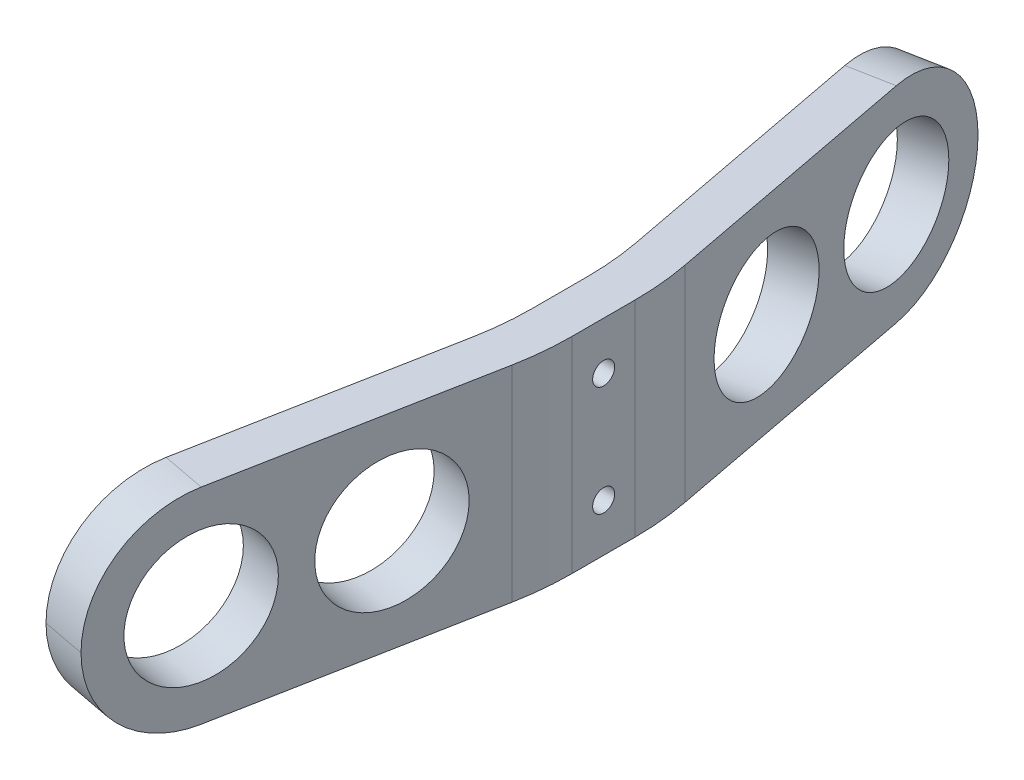
ISO-10303-21;
HEADER;
FILE_DESCRIPTION(('STEP AP214'),'2;1');
FILE_NAME('part.step','',(''),(''),'','','');
FILE_SCHEMA(('AUTOMOTIVE_DESIGN { 1 0 10303 214 1 1 1 1 }'));
ENDSEC;
DATA;
#1=APPLICATION_CONTEXT('core data for automotive mechanical design processes');
#2=APPLICATION_PROTOCOL_DEFINITION('international standard','automotive_design',2000,#1);
#3=PRODUCT_CONTEXT('',#1,'mechanical');
#4=PRODUCT('Part','Part','',(#3));
#5=PRODUCT_RELATED_PRODUCT_CATEGORY('part','',(#4));
#6=PRODUCT_DEFINITION_FORMATION('','',#4);
#7=PRODUCT_DEFINITION_CONTEXT('part definition',#1,'design');
#8=PRODUCT_DEFINITION('design','',#6,#7);
#9=PRODUCT_DEFINITION_SHAPE('','',#8);
#10=(LENGTH_UNIT() NAMED_UNIT(*) SI_UNIT(.MILLI.,.METRE.));
#11=(NAMED_UNIT(*) PLANE_ANGLE_UNIT() SI_UNIT($,.RADIAN.));
#12=(NAMED_UNIT(*) SI_UNIT($,.STERADIAN.) SOLID_ANGLE_UNIT());
#13=UNCERTAINTY_MEASURE_WITH_UNIT(LENGTH_MEASURE(1.E-05),#10,'distance_accuracy_value','');
#14=(GEOMETRIC_REPRESENTATION_CONTEXT(3) GLOBAL_UNCERTAINTY_ASSIGNED_CONTEXT((#13)) GLOBAL_UNIT_ASSIGNED_CONTEXT((#10,
#11,#12)) REPRESENTATION_CONTEXT('',''));
#15=CARTESIAN_POINT('',(0.,0.,0.));
#16=DIRECTION('',(0.,0.,1.));
#17=DIRECTION('',(1.,0.,0.));
#18=AXIS2_PLACEMENT_3D('',#15,#16,#17);
#19=CARTESIAN_POINT('',(16.,28.,8.06633748964791));
#20=DIRECTION('',(-0.982338566422475,0.,-0.187112107889995));
#21=DIRECTION('',(-0.187112107889995,0.,0.982338566422475));
#22=AXIS2_PLACEMENT_3D('',#19,#20,#21);
#23=PLANE('',#22);
#24=CARTESIAN_POINT('',(8.51360090899477,14.,47.3699327174253));
#25=DIRECTION('',(0.982338566422475,0.,0.187112107889995));
#26=DIRECTION('',(0.187112107889995,0.,-0.982338566422475));
#27=AXIS2_PLACEMENT_3D('',#24,#25,#26);
#28=CIRCLE('',#27,9.);
#29=CARTESIAN_POINT('',(10.1976098800047,14.,38.5288856196231));
#30=VERTEX_POINT('',#29);
#31=EDGE_CURVE('E462',#30,#30,#28,.T.);
#32=ORIENTED_EDGE('',*,*,#31,.F.);
#33=EDGE_LOOP('',(#32));
#34=FACE_BOUND('',#33,.T.);
#35=CARTESIAN_POINT('',(12.6739731464391,14.,25.5279784708429));
#36=DIRECTION('',(0.982338566422475,0.,0.187112107889995));
#37=DIRECTION('',(0.187112107889995,0.,-0.982338566422475));
#38=AXIS2_PLACEMENT_3D('',#35,#36,#37);
#39=CIRCLE('',#38,9.);
#40=CARTESIAN_POINT('',(14.357982117449,14.,16.6869313730406));
#41=VERTEX_POINT('',#40);
#42=EDGE_CURVE('E463',#41,#41,#39,.T.);
#43=ORIENTED_EDGE('',*,*,#42,.F.);
#44=EDGE_LOOP('',(#43));
#45=FACE_BOUND('',#44,.T.);
#46=CARTESIAN_POINT('',(8.51360090899477,14.,47.3699327174253));
#47=DIRECTION('',(-0.982338566422475,0.,-0.187112107889995));
#48=DIRECTION('',(-0.187112107889995,0.,0.982338566422475));
#49=AXIS2_PLACEMENT_3D('',#46,#47,#48);
#50=CIRCLE('',#49,14.);
#51=CARTESIAN_POINT('',(8.51360090899477,28.,47.3699327174253));
#52=VERTEX_POINT('',#51);
#53=CARTESIAN_POINT('',(5.89403139853484,14.,61.12267264734));
#54=VERTEX_POINT('',#53);
#55=EDGE_CURVE('E55',#52,#54,#50,.F.);
#56=ORIENTED_EDGE('',*,*,#55,.T.);
#57=CARTESIAN_POINT('',(8.51360090899477,14.,47.3699327174253));
#58=DIRECTION('',(-0.982338566422475,0.,-0.187112107889995));
#59=DIRECTION('',(-0.187112107889995,0.,0.982338566422475));
#60=AXIS2_PLACEMENT_3D('',#57,#58,#59);
#61=CIRCLE('',#60,14.);
#62=CARTESIAN_POINT('',(8.51360090899477,0.,47.3699327174253));
#63=VERTEX_POINT('',#62);
#64=EDGE_CURVE('E217',#54,#63,#61,.F.);
#65=ORIENTED_EDGE('',*,*,#64,.T.);
#66=DIRECTION('',(0.187112107889995,0.,-0.982338566422475));
#67=VECTOR('',#66,1.);
#68=CARTESIAN_POINT('',(16.,0.,8.06633748964791));
#69=LINE('',#68,#67);
#70=CARTESIAN_POINT('',(15.293542656899,0.,11.7752385409282));
#71=VERTEX_POINT('',#70);
#72=EDGE_CURVE('E244',#63,#71,#69,.T.);
#73=ORIENTED_EDGE('',*,*,#72,.T.);
#74=DIRECTION('',(0.,-1.,0.));
#75=VECTOR('',#74,1.);
#76=CARTESIAN_POINT('',(15.293542656899,28.,11.7752385409282));
#77=LINE('',#76,#75);
#78=CARTESIAN_POINT('',(15.293542656899,28.,11.7752385409282));
#79=VERTEX_POINT('',#78);
#80=EDGE_CURVE('E145',#71,#79,#77,.F.);
#81=ORIENTED_EDGE('',*,*,#80,.T.);
#82=DIRECTION('',(0.187112107889995,0.,-0.982338566422475));
#83=VECTOR('',#82,1.);
#84=CARTESIAN_POINT('',(16.,28.,8.06633748964791));
#85=LINE('',#84,#83);
#86=EDGE_CURVE('E160',#52,#79,#85,.T.);
#87=ORIENTED_EDGE('',*,*,#86,.F.);
#88=EDGE_LOOP('',(#56,#65,#73,#81,#87));
#89=FACE_BOUND('',#88,.T.);
#90=ADVANCED_FACE('F32',(#34,#45,#89),#23,.F.);
#91=CARTESIAN_POINT('',(16.,28.,-8.06633748964794));
#92=DIRECTION('',(-1.,0.,0.));
#93=DIRECTION('',(0.,0.,1.));
#94=AXIS2_PLACEMENT_3D('',#91,#92,#93);
#95=PLANE('',#94);
#96=CARTESIAN_POINT('',(16.,21.5,0.));
#97=DIRECTION('',(1.,0.,0.));
#98=DIRECTION('',(0.,0.,-1.));
#99=AXIS2_PLACEMENT_3D('',#96,#97,#98);
#100=CIRCLE('',#99,1.5);
#101=CARTESIAN_POINT('',(16.,21.5,-1.50000000000001));
#102=VERTEX_POINT('',#101);
#103=EDGE_CURVE('E480',#102,#102,#100,.T.);
#104=ORIENTED_EDGE('',*,*,#103,.F.);
#105=EDGE_LOOP('',(#104));
#106=FACE_BOUND('',#105,.T.);
#107=CARTESIAN_POINT('',(16.,6.5,0.));
#108=DIRECTION('',(1.,0.,0.));
#109=DIRECTION('',(0.,0.,-1.));
#110=AXIS2_PLACEMENT_3D('',#107,#108,#109);
#111=CIRCLE('',#110,1.5);
#112=CARTESIAN_POINT('',(16.,6.5,-1.5));
#113=VERTEX_POINT('',#112);
#114=EDGE_CURVE('E221',#113,#113,#111,.T.);
#115=ORIENTED_EDGE('',*,*,#114,.F.);
#116=EDGE_LOOP('',(#115));
#117=FACE_BOUND('',#116,.T.);
#118=DIRECTION('',(0.,0.,-1.));
#119=VECTOR('',#118,1.);
#120=CARTESIAN_POINT('',(16.,0.,-8.06633748964794));
#121=LINE('',#120,#119);
#122=CARTESIAN_POINT('',(16.,0.,4.2907542253284));
#123=VERTEX_POINT('',#122);
#124=CARTESIAN_POINT('',(16.,0.,-4.29075422532843));
#125=VERTEX_POINT('',#124);
#126=EDGE_CURVE('E246',#123,#125,#121,.T.);
#127=ORIENTED_EDGE('',*,*,#126,.T.);
#128=DIRECTION('',(0.,-1.,0.));
#129=VECTOR('',#128,1.);
#130=CARTESIAN_POINT('',(16.,28.,-4.29075422532843));
#131=LINE('',#130,#129);
#132=CARTESIAN_POINT('',(16.,28.,-4.29075422532843));
#133=VERTEX_POINT('',#132);
#134=EDGE_CURVE('E186',#125,#133,#131,.F.);
#135=ORIENTED_EDGE('',*,*,#134,.T.);
#136=DIRECTION('',(0.,0.,-1.));
#137=VECTOR('',#136,1.);
#138=CARTESIAN_POINT('',(16.,28.,-8.06633748964794));
#139=LINE('',#138,#137);
#140=CARTESIAN_POINT('',(16.,28.,4.2907542253284));
#141=VERTEX_POINT('',#140);
#142=EDGE_CURVE('E163',#141,#133,#139,.T.);
#143=ORIENTED_EDGE('',*,*,#142,.F.);
#144=DIRECTION('',(0.,-1.,0.));
#145=VECTOR('',#144,1.);
#146=CARTESIAN_POINT('',(16.,28.,4.2907542253284));
#147=LINE('',#146,#145);
#148=EDGE_CURVE('E183',#141,#123,#147,.T.);
#149=ORIENTED_EDGE('',*,*,#148,.T.);
#150=EDGE_LOOP('',(#127,#135,#143,#149));
#151=FACE_BOUND('',#150,.T.);
#152=ADVANCED_FACE('F279',(#106,#117,#151),#95,.F.);
#153=CARTESIAN_POINT('',(5.89403139853485,28.,-61.12267264734));
#154=DIRECTION('',(-0.982338566422475,0.,0.187112107889995));
#155=DIRECTION('',(0.187112107889995,0.,0.982338566422475));
#156=AXIS2_PLACEMENT_3D('',#153,#154,#155);
#157=PLANE('',#156);
#158=CARTESIAN_POINT('',(8.51360090899477,14.,-47.3699327174253));
#159=DIRECTION('',(-0.982338566422475,0.,0.187112107889995));
#160=DIRECTION('',(0.187112107889995,0.,0.982338566422475));
#161=AXIS2_PLACEMENT_3D('',#158,#159,#160);
#162=CIRCLE('',#161,9.);
#163=CARTESIAN_POINT('',(10.1976098800047,14.,-38.5288856196231));
#164=VERTEX_POINT('',#163);
#165=EDGE_CURVE('E438',#164,#164,#162,.T.);
#166=ORIENTED_EDGE('',*,*,#165,.T.);
#167=EDGE_LOOP('',(#166));
#168=FACE_BOUND('',#167,.T.);
#169=CARTESIAN_POINT('',(12.6739731464391,14.,-25.5279784708429));
#170=DIRECTION('',(-0.982338566422475,0.,0.187112107889995));
#171=DIRECTION('',(0.187112107889995,0.,0.982338566422475));
#172=AXIS2_PLACEMENT_3D('',#169,#170,#171);
#173=CIRCLE('',#172,9.);
#174=CARTESIAN_POINT('',(14.357982117449,14.,-16.6869313730406));
#175=VERTEX_POINT('',#174);
#176=EDGE_CURVE('E442',#175,#175,#173,.T.);
#177=ORIENTED_EDGE('',*,*,#176,.T.);
#178=EDGE_LOOP('',(#177));
#179=FACE_BOUND('',#178,.T.);
#180=DIRECTION('',(-0.187112107889995,0.,-0.982338566422475));
#181=VECTOR('',#180,1.);
#182=CARTESIAN_POINT('',(5.89403139853485,0.,-61.12267264734));
#183=LINE('',#182,#181);
#184=CARTESIAN_POINT('',(15.293542656899,0.,-11.7752385409282));
#185=VERTEX_POINT('',#184);
#186=CARTESIAN_POINT('',(8.51360090899478,0.,-47.3699327174253));
#187=VERTEX_POINT('',#186);
#188=EDGE_CURVE('E250',#185,#187,#183,.T.);
#189=ORIENTED_EDGE('',*,*,#188,.T.);
#190=CARTESIAN_POINT('',(8.51360090899478,14.,-47.3699327174253));
#191=DIRECTION('',(-0.982338566422475,0.,0.187112107889995));
#192=DIRECTION('',(0.187112107889995,0.,0.982338566422475));
#193=AXIS2_PLACEMENT_3D('',#190,#191,#192);
#194=CIRCLE('',#193,14.);
#195=CARTESIAN_POINT('',(5.89403139853485,14.,-61.12267264734));
#196=VERTEX_POINT('',#195);
#197=EDGE_CURVE('E210',#187,#196,#194,.F.);
#198=ORIENTED_EDGE('',*,*,#197,.T.);
#199=CARTESIAN_POINT('',(8.51360090899478,14.,-47.3699327174253));
#200=DIRECTION('',(-0.982338566422475,0.,0.187112107889995));
#201=DIRECTION('',(0.187112107889995,0.,0.982338566422475));
#202=AXIS2_PLACEMENT_3D('',#199,#200,#201);
#203=CIRCLE('',#202,14.);
#204=CARTESIAN_POINT('',(8.51360090899478,28.,-47.3699327174253));
#205=VERTEX_POINT('',#204);
#206=EDGE_CURVE('E208',#196,#205,#203,.F.);
#207=ORIENTED_EDGE('',*,*,#206,.T.);
#208=DIRECTION('',(-0.187112107889995,0.,-0.982338566422475));
#209=VECTOR('',#208,1.);
#210=CARTESIAN_POINT('',(5.89403139853485,28.,-61.12267264734));
#211=LINE('',#210,#209);
#212=CARTESIAN_POINT('',(15.293542656899,28.,-11.7752385409282));
#213=VERTEX_POINT('',#212);
#214=EDGE_CURVE('E454',#213,#205,#211,.T.);
#215=ORIENTED_EDGE('',*,*,#214,.F.);
#216=DIRECTION('',(0.,-1.,0.));
#217=VECTOR('',#216,1.);
#218=CARTESIAN_POINT('',(15.293542656899,28.,-11.7752385409282));
#219=LINE('',#218,#217);
#220=EDGE_CURVE('E175',#213,#185,#219,.T.);
#221=ORIENTED_EDGE('',*,*,#220,.T.);
#222=EDGE_LOOP('',(#189,#198,#207,#215,#221));
#223=FACE_BOUND('',#222,.T.);
#224=ADVANCED_FACE('F273',(#168,#179,#223),#157,.F.);
#225=CARTESIAN_POINT('',(0.,28.,-60.));
#226=DIRECTION('',(0.982338566422475,0.,-0.187112107889995));
#227=DIRECTION('',(-0.187112107889995,0.,-0.982338566422475));
#228=AXIS2_PLACEMENT_3D('',#225,#226,#227);
#229=PLANE('',#228);
#230=CARTESIAN_POINT('',(2.61956951045993,14.,-46.2472600700854));
#231=DIRECTION('',(0.982338566422475,0.,-0.187112107889995));
#232=DIRECTION('',(-0.187112107889995,0.,-0.982338566422475));
#233=AXIS2_PLACEMENT_3D('',#230,#231,#232);
#234=CIRCLE('',#233,9.);
#235=CARTESIAN_POINT('',(0.935560539449972,14.,-55.0883071678876));
#236=VERTEX_POINT('',#235);
#237=EDGE_CURVE('E475',#236,#236,#234,.T.);
#238=ORIENTED_EDGE('',*,*,#237,.T.);
#239=EDGE_LOOP('',(#238));
#240=FACE_BOUND('',#239,.T.);
#241=CARTESIAN_POINT('',(6.77994174790421,14.,-24.4053058235029));
#242=DIRECTION('',(0.982338566422475,0.,-0.187112107889995));
#243=DIRECTION('',(-0.187112107889995,0.,-0.982338566422475));
#244=AXIS2_PLACEMENT_3D('',#241,#242,#243);
#245=CIRCLE('',#244,9.);
#246=CARTESIAN_POINT('',(5.09593277689425,14.,-33.2463529213052));
#247=VERTEX_POINT('',#246);
#248=EDGE_CURVE('E470',#247,#247,#245,.T.);
#249=ORIENTED_EDGE('',*,*,#248,.T.);
#250=EDGE_LOOP('',(#249));
#251=FACE_BOUND('',#250,.T.);
#252=CARTESIAN_POINT('',(2.61956951045993,14.,-46.2472600700854));
#253=DIRECTION('',(0.982338566422475,0.,-0.187112107889995));
#254=DIRECTION('',(-0.187112107889995,0.,-0.982338566422475));
#255=AXIS2_PLACEMENT_3D('',#252,#253,#254);
#256=CIRCLE('',#255,14.);
#257=CARTESIAN_POINT('',(2.61956951045993,28.,-46.2472600700854));
#258=VERTEX_POINT('',#257);
#259=CARTESIAN_POINT('',(0.,14.,-60.));
#260=VERTEX_POINT('',#259);
#261=EDGE_CURVE('E200',#258,#260,#256,.F.);
#262=ORIENTED_EDGE('',*,*,#261,.T.);
#263=CARTESIAN_POINT('',(2.61956951045993,14.,-46.2472600700854));
#264=DIRECTION('',(0.982338566422475,0.,-0.187112107889995));
#265=DIRECTION('',(-0.187112107889995,0.,-0.982338566422475));
#266=AXIS2_PLACEMENT_3D('',#263,#264,#265);
#267=CIRCLE('',#266,14.);
#268=CARTESIAN_POINT('',(2.61956951045993,0.,-46.2472600700854));
#269=VERTEX_POINT('',#268);
#270=EDGE_CURVE('E202',#260,#269,#267,.F.);
#271=ORIENTED_EDGE('',*,*,#270,.T.);
#272=DIRECTION('',(0.187112107889995,0.,0.982338566422475));
#273=VECTOR('',#272,1.);
#274=CARTESIAN_POINT('',(0.,0.,-60.));
#275=LINE('',#274,#273);
#276=CARTESIAN_POINT('',(9.293542656899,0.,-11.2089010512803));
#277=VERTEX_POINT('',#276);
#278=EDGE_CURVE('E165',#269,#277,#275,.T.);
#279=ORIENTED_EDGE('',*,*,#278,.T.);
#280=DIRECTION('',(0.,-1.,0.));
#281=VECTOR('',#280,1.);
#282=CARTESIAN_POINT('',(9.293542656899,28.,-11.2089010512803));
#283=LINE('',#282,#281);
#284=CARTESIAN_POINT('',(9.293542656899,28.,-11.2089010512803));
#285=VERTEX_POINT('',#284);
#286=EDGE_CURVE('E172',#277,#285,#283,.F.);
#287=ORIENTED_EDGE('',*,*,#286,.T.);
#288=DIRECTION('',(0.187112107889995,0.,0.982338566422475));
#289=VECTOR('',#288,1.);
#290=CARTESIAN_POINT('',(0.,28.,-60.));
#291=LINE('',#290,#289);
#292=EDGE_CURVE('E240',#258,#285,#291,.T.);
#293=ORIENTED_EDGE('',*,*,#292,.F.);
#294=EDGE_LOOP('',(#262,#271,#279,#287,#293));
#295=FACE_BOUND('',#294,.T.);
#296=ADVANCED_FACE('F253',(#240,#251,#295),#229,.F.);
#297=CARTESIAN_POINT('',(10.,28.,-7.5));
#298=DIRECTION('',(1.,0.,0.));
#299=DIRECTION('',(0.,0.,-1.));
#300=AXIS2_PLACEMENT_3D('',#297,#298,#299);
#301=PLANE('',#300);
#302=CARTESIAN_POINT('',(10.,21.5,0.));
#303=DIRECTION('',(1.,0.,0.));
#304=DIRECTION('',(0.,0.,-1.));
#305=AXIS2_PLACEMENT_3D('',#302,#303,#304);
#306=CIRCLE('',#305,1.5);
#307=CARTESIAN_POINT('',(10.,21.5,-1.5));
#308=VERTEX_POINT('',#307);
#309=EDGE_CURVE('E473',#308,#308,#306,.F.);
#310=ORIENTED_EDGE('',*,*,#309,.F.);
#311=EDGE_LOOP('',(#310));
#312=FACE_BOUND('',#311,.T.);
#313=CARTESIAN_POINT('',(10.,6.5,0.));
#314=DIRECTION('',(1.,0.,0.));
#315=DIRECTION('',(0.,0.,-1.));
#316=AXIS2_PLACEMENT_3D('',#313,#314,#315);
#317=CIRCLE('',#316,1.5);
#318=CARTESIAN_POINT('',(10.,6.5,-1.5));
#319=VERTEX_POINT('',#318);
#320=EDGE_CURVE('E226',#319,#319,#317,.F.);
#321=ORIENTED_EDGE('',*,*,#320,.F.);
#322=EDGE_LOOP('',(#321));
#323=FACE_BOUND('',#322,.T.);
#324=DIRECTION('',(0.,0.,1.));
#325=VECTOR('',#324,1.);
#326=CARTESIAN_POINT('',(10.,0.,-7.5));
#327=LINE('',#326,#325);
#328=CARTESIAN_POINT('',(10.,0.,-3.72441673568047));
#329=VERTEX_POINT('',#328);
#330=CARTESIAN_POINT('',(10.,0.,3.72441673568047));
#331=VERTEX_POINT('',#330);
#332=EDGE_CURVE('E161',#329,#331,#327,.T.);
#333=ORIENTED_EDGE('',*,*,#332,.T.);
#334=DIRECTION('',(0.,-1.,0.));
#335=VECTOR('',#334,1.);
#336=CARTESIAN_POINT('',(10.,28.,3.72441673568047));
#337=LINE('',#336,#335);
#338=CARTESIAN_POINT('',(10.,28.,3.72441673568047));
#339=VERTEX_POINT('',#338);
#340=EDGE_CURVE('E139',#331,#339,#337,.F.);
#341=ORIENTED_EDGE('',*,*,#340,.T.);
#342=DIRECTION('',(0.,0.,1.));
#343=VECTOR('',#342,1.);
#344=CARTESIAN_POINT('',(10.,28.,-7.5));
#345=LINE('',#344,#343);
#346=CARTESIAN_POINT('',(10.,28.,-3.72441673568047));
#347=VERTEX_POINT('',#346);
#348=EDGE_CURVE('E238',#347,#339,#345,.T.);
#349=ORIENTED_EDGE('',*,*,#348,.F.);
#350=DIRECTION('',(0.,-1.,0.));
#351=VECTOR('',#350,1.);
#352=CARTESIAN_POINT('',(10.,0.,-3.72441673568047));
#353=LINE('',#352,#351);
#354=EDGE_CURVE('E152',#347,#329,#353,.T.);
#355=ORIENTED_EDGE('',*,*,#354,.T.);
#356=EDGE_LOOP('',(#333,#341,#349,#355));
#357=FACE_BOUND('',#356,.T.);
#358=ADVANCED_FACE('F263',(#312,#323,#357),#301,.F.);
#359=CARTESIAN_POINT('',(10.,28.,7.5));
#360=DIRECTION('',(0.982338566422475,0.,0.187112107889995));
#361=DIRECTION('',(0.187112107889995,0.,-0.982338566422475));
#362=AXIS2_PLACEMENT_3D('',#359,#360,#361);
#363=PLANE('',#362);
#364=CARTESIAN_POINT('',(2.61956951045993,14.,46.2472600700854));
#365=DIRECTION('',(0.982338566422475,0.,0.187112107889995));
#366=DIRECTION('',(0.187112107889995,0.,-0.982338566422475));
#367=AXIS2_PLACEMENT_3D('',#364,#365,#366);
#368=CIRCLE('',#367,9.);
#369=CARTESIAN_POINT('',(4.30357848146989,14.,37.4062129722831));
#370=VERTEX_POINT('',#369);
#371=EDGE_CURVE('E247',#370,#370,#368,.F.);
#372=ORIENTED_EDGE('',*,*,#371,.F.);
#373=EDGE_LOOP('',(#372));
#374=FACE_BOUND('',#373,.T.);
#375=CARTESIAN_POINT('',(6.77994174790421,14.,24.4053058235029));
#376=DIRECTION('',(0.982338566422475,0.,0.187112107889995));
#377=DIRECTION('',(0.187112107889995,0.,-0.982338566422475));
#378=AXIS2_PLACEMENT_3D('',#375,#376,#377);
#379=CIRCLE('',#378,9.);
#380=CARTESIAN_POINT('',(8.46395071891417,14.,15.5642587257006));
#381=VERTEX_POINT('',#380);
#382=EDGE_CURVE('E459',#381,#381,#379,.F.);
#383=ORIENTED_EDGE('',*,*,#382,.F.);
#384=EDGE_LOOP('',(#383));
#385=FACE_BOUND('',#384,.T.);
#386=DIRECTION('',(-0.187112107889995,0.,0.982338566422475));
#387=VECTOR('',#386,1.);
#388=CARTESIAN_POINT('',(10.,0.,7.5));
#389=LINE('',#388,#387);
#390=CARTESIAN_POINT('',(9.293542656899,0.,11.2089010512803));
#391=VERTEX_POINT('',#390);
#392=CARTESIAN_POINT('',(2.61956951045993,0.,46.2472600700854));
#393=VERTEX_POINT('',#392);
#394=EDGE_CURVE('E149',#391,#393,#389,.T.);
#395=ORIENTED_EDGE('',*,*,#394,.T.);
#396=CARTESIAN_POINT('',(2.61956951045993,14.,46.2472600700854));
#397=DIRECTION('',(0.982338566422475,0.,0.187112107889995));
#398=DIRECTION('',(0.187112107889995,0.,-0.982338566422475));
#399=AXIS2_PLACEMENT_3D('',#396,#397,#398);
#400=CIRCLE('',#399,14.);
#401=CARTESIAN_POINT('',(0.,14.,60.));
#402=VERTEX_POINT('',#401);
#403=EDGE_CURVE('E11',#393,#402,#400,.F.);
#404=ORIENTED_EDGE('',*,*,#403,.T.);
#405=CARTESIAN_POINT('',(2.61956951045994,14.,46.2472600700854));
#406=DIRECTION('',(0.982338566422475,0.,0.187112107889995));
#407=DIRECTION('',(0.187112107889995,0.,-0.982338566422475));
#408=AXIS2_PLACEMENT_3D('',#405,#406,#407);
#409=CIRCLE('',#408,14.);
#410=CARTESIAN_POINT('',(2.61956951045993,28.,46.2472600700854));
#411=VERTEX_POINT('',#410);
#412=EDGE_CURVE('E41',#402,#411,#409,.F.);
#413=ORIENTED_EDGE('',*,*,#412,.T.);
#414=DIRECTION('',(-0.187112107889995,0.,0.982338566422475));
#415=VECTOR('',#414,1.);
#416=CARTESIAN_POINT('',(10.,28.,7.5));
#417=LINE('',#416,#415);
#418=CARTESIAN_POINT('',(9.293542656899,28.,11.2089010512803));
#419=VERTEX_POINT('',#418);
#420=EDGE_CURVE('E151',#419,#411,#417,.T.);
#421=ORIENTED_EDGE('',*,*,#420,.F.);
#422=DIRECTION('',(0.,-1.,0.));
#423=VECTOR('',#422,1.);
#424=CARTESIAN_POINT('',(9.293542656899,0.,11.2089010512803));
#425=LINE('',#424,#423);
#426=EDGE_CURVE('E138',#419,#391,#425,.T.);
#427=ORIENTED_EDGE('',*,*,#426,.T.);
#428=EDGE_LOOP('',(#395,#404,#413,#421,#427));
#429=FACE_BOUND('',#428,.T.);
#430=ADVANCED_FACE('F148',(#374,#385,#429),#363,.F.);
#431=CARTESIAN_POINT('',(0.,28.,0.));
#432=DIRECTION('',(0.,-1.,0.));
#433=DIRECTION('',(0.,0.,-1.));
#434=AXIS2_PLACEMENT_3D('',#431,#432,#433);
#435=PLANE('',#434);
#436=ORIENTED_EDGE('',*,*,#214,.T.);
#437=DIRECTION('',(-0.982338566422475,0.,0.187112107889995));
#438=VECTOR('',#437,1.);
#439=CARTESIAN_POINT('',(-8.40887687903679,28.,-44.1466036149431));
#440=LINE('',#439,#438);
#441=EDGE_CURVE('E214',#205,#258,#440,.T.);
#442=ORIENTED_EDGE('',*,*,#441,.T.);
#443=ORIENTED_EDGE('',*,*,#292,.T.);
#444=CARTESIAN_POINT('',(-30.,28.,-3.72441673568047));
#445=DIRECTION('',(0.,-1.,0.));
#446=DIRECTION('',(0.,0.,-1.));
#447=AXIS2_PLACEMENT_3D('',#444,#445,#446);
#448=CIRCLE('',#447,40.);
#449=EDGE_CURVE('E198',#285,#347,#448,.T.);
#450=ORIENTED_EDGE('',*,*,#449,.T.);
#451=ORIENTED_EDGE('',*,*,#348,.T.);
#452=CARTESIAN_POINT('',(-30.,28.,3.72441673568047));
#453=DIRECTION('',(0.,-1.,0.));
#454=DIRECTION('',(0.,0.,-1.));
#455=AXIS2_PLACEMENT_3D('',#452,#453,#454);
#456=CIRCLE('',#455,40.);
#457=EDGE_CURVE('E144',#339,#419,#456,.T.);
#458=ORIENTED_EDGE('',*,*,#457,.T.);
#459=ORIENTED_EDGE('',*,*,#420,.T.);
#460=DIRECTION('',(0.982338566422475,0.,0.187112107889996));
#461=VECTOR('',#460,1.);
#462=CARTESIAN_POINT('',(-8.4088768790368,28.,44.1466036149431));
#463=LINE('',#462,#461);
#464=EDGE_CURVE('E212',#411,#52,#463,.T.);
#465=ORIENTED_EDGE('',*,*,#464,.T.);
#466=ORIENTED_EDGE('',*,*,#86,.T.);
#467=CARTESIAN_POINT('',(-24.,28.,4.29075422532841));
#468=DIRECTION('',(0.,-1.,0.));
#469=DIRECTION('',(0.,0.,-1.));
#470=AXIS2_PLACEMENT_3D('',#467,#468,#469);
#471=CIRCLE('',#470,40.);
#472=EDGE_CURVE('E188',#79,#141,#471,.F.);
#473=ORIENTED_EDGE('',*,*,#472,.T.);
#474=ORIENTED_EDGE('',*,*,#142,.T.);
#475=CARTESIAN_POINT('',(-24.,28.,-4.29075422532842));
#476=DIRECTION('',(0.,-1.,0.));
#477=DIRECTION('',(0.,0.,-1.));
#478=AXIS2_PLACEMENT_3D('',#475,#476,#477);
#479=CIRCLE('',#478,40.);
#480=EDGE_CURVE('E190',#133,#213,#479,.F.);
#481=ORIENTED_EDGE('',*,*,#480,.T.);
#482=EDGE_LOOP('',(#436,#442,#443,#450,#451,#458,#459,#465,#466,#473,#474,#481));
#483=FACE_BOUND('',#482,.T.);
#484=ADVANCED_FACE('F236',(#483),#435,.F.);
#485=CARTESIAN_POINT('',(0.,0.,0.));
#486=DIRECTION('',(0.,-1.,0.));
#487=DIRECTION('',(0.,0.,-1.));
#488=AXIS2_PLACEMENT_3D('',#485,#486,#487);
#489=PLANE('',#488);
#490=ORIENTED_EDGE('',*,*,#278,.F.);
#491=DIRECTION('',(-0.982338566422475,0.,0.187112107889995));
#492=VECTOR('',#491,1.);
#493=CARTESIAN_POINT('',(8.51360090899478,0.,-47.3699327174253));
#494=LINE('',#493,#492);
#495=EDGE_CURVE('E205',#269,#187,#494,.F.);
#496=ORIENTED_EDGE('',*,*,#495,.T.);
#497=ORIENTED_EDGE('',*,*,#188,.F.);
#498=CARTESIAN_POINT('',(-24.,0.,-4.29075422532842));
#499=DIRECTION('',(0.,-1.,0.));
#500=DIRECTION('',(0.,0.,-1.));
#501=AXIS2_PLACEMENT_3D('',#498,#499,#500);
#502=CIRCLE('',#501,40.);
#503=EDGE_CURVE('E181',#185,#125,#502,.T.);
#504=ORIENTED_EDGE('',*,*,#503,.T.);
#505=ORIENTED_EDGE('',*,*,#126,.F.);
#506=CARTESIAN_POINT('',(-24.,0.,4.29075422532841));
#507=DIRECTION('',(0.,-1.,0.));
#508=DIRECTION('',(0.,0.,-1.));
#509=AXIS2_PLACEMENT_3D('',#506,#507,#508);
#510=CIRCLE('',#509,40.);
#511=EDGE_CURVE('E178',#123,#71,#510,.T.);
#512=ORIENTED_EDGE('',*,*,#511,.T.);
#513=ORIENTED_EDGE('',*,*,#72,.F.);
#514=DIRECTION('',(0.982338566422475,0.,0.187112107889996));
#515=VECTOR('',#514,1.);
#516=CARTESIAN_POINT('',(2.61956951045994,0.,46.2472600700854));
#517=LINE('',#516,#515);
#518=EDGE_CURVE('E159',#63,#393,#517,.F.);
#519=ORIENTED_EDGE('',*,*,#518,.T.);
#520=ORIENTED_EDGE('',*,*,#394,.F.);
#521=CARTESIAN_POINT('',(-30.,0.,3.72441673568047));
#522=DIRECTION('',(0.,-1.,0.));
#523=DIRECTION('',(0.,0.,-1.));
#524=AXIS2_PLACEMENT_3D('',#521,#522,#523);
#525=CIRCLE('',#524,40.);
#526=EDGE_CURVE('E134',#391,#331,#525,.F.);
#527=ORIENTED_EDGE('',*,*,#526,.T.);
#528=ORIENTED_EDGE('',*,*,#332,.F.);
#529=CARTESIAN_POINT('',(-30.,0.,-3.72441673568047));
#530=DIRECTION('',(0.,-1.,0.));
#531=DIRECTION('',(0.,0.,-1.));
#532=AXIS2_PLACEMENT_3D('',#529,#530,#531);
#533=CIRCLE('',#532,40.);
#534=EDGE_CURVE('E195',#329,#277,#533,.F.);
#535=ORIENTED_EDGE('',*,*,#534,.T.);
#536=EDGE_LOOP('',(#490,#496,#497,#504,#505,#512,#513,#519,#520,#527,#528,#535));
#537=FACE_BOUND('',#536,.T.);
#538=ADVANCED_FACE('F156',(#537),#489,.T.);
#539=CARTESIAN_POINT('',(-30.,28.,3.72441673568047));
#540=DIRECTION('',(0.,1.,0.));
#541=DIRECTION('',(0.,0.,1.));
#542=AXIS2_PLACEMENT_3D('',#539,#540,#541);
#543=CYLINDRICAL_SURFACE('',#542,40.);
#544=ORIENTED_EDGE('',*,*,#457,.F.);
#545=ORIENTED_EDGE('',*,*,#340,.F.);
#546=ORIENTED_EDGE('',*,*,#526,.F.);
#547=ORIENTED_EDGE('',*,*,#426,.F.);
#548=EDGE_LOOP('',(#544,#545,#546,#547));
#549=FACE_BOUND('',#548,.T.);
#550=ADVANCED_FACE('F137',(#549),#543,.F.);
#551=CARTESIAN_POINT('',(-30.,28.,-3.72441673568047));
#552=DIRECTION('',(0.,1.,0.));
#553=DIRECTION('',(0.,0.,1.));
#554=AXIS2_PLACEMENT_3D('',#551,#552,#553);
#555=CYLINDRICAL_SURFACE('',#554,40.);
#556=ORIENTED_EDGE('',*,*,#449,.F.);
#557=ORIENTED_EDGE('',*,*,#286,.F.);
#558=ORIENTED_EDGE('',*,*,#534,.F.);
#559=ORIENTED_EDGE('',*,*,#354,.F.);
#560=EDGE_LOOP('',(#556,#557,#558,#559));
#561=FACE_BOUND('',#560,.T.);
#562=ADVANCED_FACE('F260',(#561),#555,.F.);
#563=CARTESIAN_POINT('',(-24.,28.,-4.29075422532842));
#564=DIRECTION('',(0.,-1.,0.));
#565=DIRECTION('',(0.,0.,-1.));
#566=AXIS2_PLACEMENT_3D('',#563,#564,#565);
#567=CYLINDRICAL_SURFACE('',#566,40.);
#568=ORIENTED_EDGE('',*,*,#480,.F.);
#569=ORIENTED_EDGE('',*,*,#134,.F.);
#570=ORIENTED_EDGE('',*,*,#503,.F.);
#571=ORIENTED_EDGE('',*,*,#220,.F.);
#572=EDGE_LOOP('',(#568,#569,#570,#571));
#573=FACE_BOUND('',#572,.T.);
#574=ADVANCED_FACE('F295',(#573),#567,.T.);
#575=CARTESIAN_POINT('',(-24.,28.,4.29075422532841));
#576=DIRECTION('',(0.,-1.,0.));
#577=DIRECTION('',(0.,0.,-1.));
#578=AXIS2_PLACEMENT_3D('',#575,#576,#577);
#579=CYLINDRICAL_SURFACE('',#578,40.);
#580=ORIENTED_EDGE('',*,*,#472,.F.);
#581=ORIENTED_EDGE('',*,*,#80,.F.);
#582=ORIENTED_EDGE('',*,*,#511,.F.);
#583=ORIENTED_EDGE('',*,*,#148,.F.);
#584=EDGE_LOOP('',(#580,#581,#582,#583));
#585=FACE_BOUND('',#584,.T.);
#586=ADVANCED_FACE('F298',(#585),#579,.T.);
#587=CARTESIAN_POINT('',(-15.4844554126572,14.,20.1644682691103));
#588=DIRECTION('',(0.982338566422475,0.,0.187112107889995));
#589=DIRECTION('',(0.187112107889995,0.,-0.982338566422475));
#590=AXIS2_PLACEMENT_3D('',#587,#588,#589);
#591=CYLINDRICAL_SURFACE('',#590,9.);
#592=ORIENTED_EDGE('',*,*,#42,.T.);
#593=EDGE_LOOP('',(#592));
#594=FACE_BOUND('',#593,.T.);
#595=ORIENTED_EDGE('',*,*,#382,.T.);
#596=EDGE_LOOP('',(#595));
#597=FACE_BOUND('',#596,.T.);
#598=ADVANCED_FACE('F302',(#594,#597),#591,.F.);
#599=CARTESIAN_POINT('',(-19.6448276501015,14.,42.0064225156927));
#600=DIRECTION('',(0.982338566422475,0.,0.187112107889995));
#601=DIRECTION('',(0.187112107889995,0.,-0.982338566422475));
#602=AXIS2_PLACEMENT_3D('',#599,#600,#601);
#603=CYLINDRICAL_SURFACE('',#602,9.);
#604=ORIENTED_EDGE('',*,*,#31,.T.);
#605=EDGE_LOOP('',(#604));
#606=FACE_BOUND('',#605,.T.);
#607=ORIENTED_EDGE('',*,*,#371,.T.);
#608=EDGE_LOOP('',(#607));
#609=FACE_BOUND('',#608,.T.);
#610=ADVANCED_FACE('F357',(#606,#609),#603,.F.);
#611=CARTESIAN_POINT('',(-15.4844554126572,14.,-20.1644682691103));
#612=DIRECTION('',(0.982338566422475,0.,-0.187112107889995));
#613=DIRECTION('',(-0.187112107889995,0.,-0.982338566422475));
#614=AXIS2_PLACEMENT_3D('',#611,#612,#613);
#615=CYLINDRICAL_SURFACE('',#614,9.);
#616=ORIENTED_EDGE('',*,*,#176,.F.);
#617=EDGE_LOOP('',(#616));
#618=FACE_BOUND('',#617,.T.);
#619=ORIENTED_EDGE('',*,*,#248,.F.);
#620=EDGE_LOOP('',(#619));
#621=FACE_BOUND('',#620,.T.);
#622=ADVANCED_FACE('F348',(#618,#621),#615,.F.);
#623=CARTESIAN_POINT('',(-19.6448276501015,14.,-42.0064225156927));
#624=DIRECTION('',(0.982338566422475,0.,-0.187112107889995));
#625=DIRECTION('',(-0.187112107889995,0.,-0.982338566422475));
#626=AXIS2_PLACEMENT_3D('',#623,#624,#625);
#627=CYLINDRICAL_SURFACE('',#626,9.);
#628=ORIENTED_EDGE('',*,*,#165,.F.);
#629=EDGE_LOOP('',(#628));
#630=FACE_BOUND('',#629,.T.);
#631=ORIENTED_EDGE('',*,*,#237,.F.);
#632=EDGE_LOOP('',(#631));
#633=FACE_BOUND('',#632,.T.);
#634=ADVANCED_FACE('F340',(#630,#633),#627,.F.);
#635=CARTESIAN_POINT('',(-0.00100000000001488,6.5,0.));
#636=DIRECTION('',(1.,0.,0.));
#637=DIRECTION('',(0.,0.,-1.));
#638=AXIS2_PLACEMENT_3D('',#635,#636,#637);
#639=CYLINDRICAL_SURFACE('',#638,1.5);
#640=ORIENTED_EDGE('',*,*,#114,.T.);
#641=EDGE_LOOP('',(#640));
#642=FACE_BOUND('',#641,.T.);
#643=ORIENTED_EDGE('',*,*,#320,.T.);
#644=EDGE_LOOP('',(#643));
#645=FACE_BOUND('',#644,.T.);
#646=ADVANCED_FACE('F332',(#642,#645),#639,.F.);
#647=CARTESIAN_POINT('',(-0.00100000000001488,21.5,0.));
#648=DIRECTION('',(1.,0.,0.));
#649=DIRECTION('',(0.,0.,-1.));
#650=AXIS2_PLACEMENT_3D('',#647,#648,#649);
#651=CYLINDRICAL_SURFACE('',#650,1.5);
#652=ORIENTED_EDGE('',*,*,#103,.T.);
#653=EDGE_LOOP('',(#652));
#654=FACE_BOUND('',#653,.T.);
#655=ORIENTED_EDGE('',*,*,#309,.T.);
#656=EDGE_LOOP('',(#655));
#657=FACE_BOUND('',#656,.T.);
#658=ADVANCED_FACE('F309',(#654,#657),#651,.F.);
#659=CARTESIAN_POINT('',(-8.40887687903679,14.,-44.1466036149431));
#660=DIRECTION('',(-0.982338566422475,0.,0.187112107889995));
#661=DIRECTION('',(0.187112107889995,0.,0.982338566422475));
#662=AXIS2_PLACEMENT_3D('',#659,#660,#661);
#663=CYLINDRICAL_SURFACE('',#662,14.);
#664=ORIENTED_EDGE('',*,*,#441,.F.);
#665=ORIENTED_EDGE('',*,*,#206,.F.);
#666=DIRECTION('',(-0.982338566422475,0.,0.187112107889995));
#667=VECTOR('',#666,1.);
#668=CARTESIAN_POINT('',(0.,14.,-60.));
#669=LINE('',#668,#667);
#670=EDGE_CURVE('E219',#260,#196,#669,.F.);
#671=ORIENTED_EDGE('',*,*,#670,.F.);
#672=ORIENTED_EDGE('',*,*,#261,.F.);
#673=EDGE_LOOP('',(#664,#665,#671,#672));
#674=FACE_BOUND('',#673,.T.);
#675=ADVANCED_FACE('F307',(#674),#663,.T.);
#676=CARTESIAN_POINT('',(2.61956951045993,14.,-46.2472600700854));
#677=DIRECTION('',(0.982338566422475,0.,-0.187112107889995));
#678=DIRECTION('',(-0.187112107889995,0.,-0.982338566422475));
#679=AXIS2_PLACEMENT_3D('',#676,#677,#678);
#680=CYLINDRICAL_SURFACE('',#679,14.);
#681=ORIENTED_EDGE('',*,*,#197,.F.);
#682=ORIENTED_EDGE('',*,*,#495,.F.);
#683=ORIENTED_EDGE('',*,*,#270,.F.);
#684=ORIENTED_EDGE('',*,*,#670,.T.);
#685=EDGE_LOOP('',(#681,#682,#683,#684));
#686=FACE_BOUND('',#685,.T.);
#687=ADVANCED_FACE('F304',(#686),#680,.T.);
#688=CARTESIAN_POINT('',(-8.4088768790368,14.,44.1466036149431));
#689=DIRECTION('',(0.982338566422475,0.,0.187112107889996));
#690=DIRECTION('',(0.187112107889996,0.,-0.982338566422475));
#691=AXIS2_PLACEMENT_3D('',#688,#689,#690);
#692=CYLINDRICAL_SURFACE('',#691,14.);
#693=ORIENTED_EDGE('',*,*,#464,.F.);
#694=ORIENTED_EDGE('',*,*,#412,.F.);
#695=DIRECTION('',(0.982338566422475,0.,0.187112107889996));
#696=VECTOR('',#695,1.);
#697=CARTESIAN_POINT('',(0.,14.,60.));
#698=LINE('',#697,#696);
#699=EDGE_CURVE('E36',#54,#402,#698,.F.);
#700=ORIENTED_EDGE('',*,*,#699,.F.);
#701=ORIENTED_EDGE('',*,*,#55,.F.);
#702=EDGE_LOOP('',(#693,#694,#700,#701));
#703=FACE_BOUND('',#702,.T.);
#704=ADVANCED_FACE('F34',(#703),#692,.T.);
#705=CARTESIAN_POINT('',(2.61956951045994,14.,46.2472600700854));
#706=DIRECTION('',(-0.982338566422475,0.,-0.187112107889996));
#707=DIRECTION('',(-0.187112107889996,0.,0.982338566422475));
#708=AXIS2_PLACEMENT_3D('',#705,#706,#707);
#709=CYLINDRICAL_SURFACE('',#708,14.);
#710=ORIENTED_EDGE('',*,*,#403,.F.);
#711=ORIENTED_EDGE('',*,*,#518,.F.);
#712=ORIENTED_EDGE('',*,*,#64,.F.);
#713=ORIENTED_EDGE('',*,*,#699,.T.);
#714=EDGE_LOOP('',(#710,#711,#712,#713));
#715=FACE_BOUND('',#714,.T.);
#716=ADVANCED_FACE('F231',(#715),#709,.T.);
#717=CLOSED_SHELL('',(#90,#152,#224,#296,#358,#430,#484,#538,#550,#562,#574,#586,#598,#610,#622,
#634,#646,#658,#675,#687,#704,#716));
#718=MANIFOLD_SOLID_BREP('B2',#717);
#719=ADVANCED_BREP_SHAPE_REPRESENTATION('',(#18,#718),#14);
#720=SHAPE_DEFINITION_REPRESENTATION(#9,#719);
ENDSEC;
END-ISO-10303-21;
